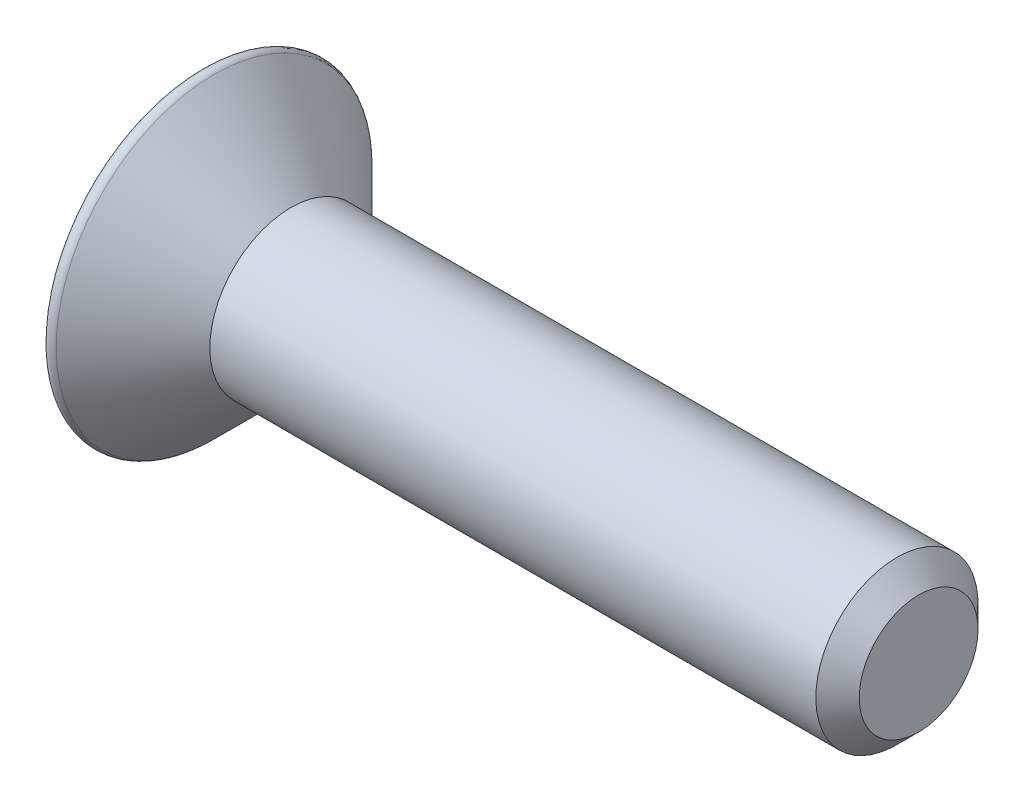
ISO-10303-21;
HEADER;
FILE_DESCRIPTION(('STEP AP214'),'2;1');
FILE_NAME('part.step','',(''),(''),'','','');
FILE_SCHEMA(('AUTOMOTIVE_DESIGN { 1 0 10303 214 1 1 1 1 }'));
ENDSEC;
DATA;
#1=APPLICATION_CONTEXT('core data for automotive mechanical design processes');
#2=APPLICATION_PROTOCOL_DEFINITION('international standard','automotive_design',2000,#1);
#3=PRODUCT_CONTEXT('',#1,'mechanical');
#4=PRODUCT('Part','Part','',(#3));
#5=PRODUCT_RELATED_PRODUCT_CATEGORY('part','',(#4));
#6=PRODUCT_DEFINITION_FORMATION('','',#4);
#7=PRODUCT_DEFINITION_CONTEXT('part definition',#1,'design');
#8=PRODUCT_DEFINITION('design','',#6,#7);
#9=PRODUCT_DEFINITION_SHAPE('','',#8);
#10=(LENGTH_UNIT() NAMED_UNIT(*) SI_UNIT(.MILLI.,.METRE.));
#11=(NAMED_UNIT(*) PLANE_ANGLE_UNIT() SI_UNIT($,.RADIAN.));
#12=(NAMED_UNIT(*) SI_UNIT($,.STERADIAN.) SOLID_ANGLE_UNIT());
#13=UNCERTAINTY_MEASURE_WITH_UNIT(LENGTH_MEASURE(1.E-05),#10,'distance_accuracy_value','');
#14=(GEOMETRIC_REPRESENTATION_CONTEXT(3) GLOBAL_UNCERTAINTY_ASSIGNED_CONTEXT((#13)) GLOBAL_UNIT_ASSIGNED_CONTEXT((#10,
#11,#12)) REPRESENTATION_CONTEXT('',''));
#15=CARTESIAN_POINT('',(0.,0.,0.));
#16=DIRECTION('',(0.,0.,1.));
#17=DIRECTION('',(1.,0.,0.));
#18=AXIS2_PLACEMENT_3D('',#15,#16,#17);
#19=CARTESIAN_POINT('',(0.,0.,0.));
#20=DIRECTION('',(1.,0.,0.));
#21=DIRECTION('',(0.,1.,0.));
#22=AXIS2_PLACEMENT_3D('',#19,#20,#21);
#23=PLANE('',#22);
#24=CARTESIAN_POINT('',(0.,0.,0.));
#25=DIRECTION('',(1.,0.,0.));
#26=DIRECTION('',(0.,1.,0.));
#27=AXIS2_PLACEMENT_3D('',#24,#25,#26);
#28=CIRCLE('',#27,1.0414);
#29=CARTESIAN_POINT('',(0.,1.0414,0.));
#30=VERTEX_POINT('',#29);
#31=EDGE_CURVE('E11',#30,#30,#28,.T.);
#32=ORIENTED_EDGE('',*,*,#31,.T.);
#33=EDGE_LOOP('',(#32));
#34=FACE_BOUND('',#33,.T.);
#35=ADVANCED_FACE('F40',(#34),#23,.T.);
#36=CARTESIAN_POINT('',(0.,0.,0.));
#37=DIRECTION('',(-1.,0.,0.));
#38=DIRECTION('',(0.,-1.,0.));
#39=AXIS2_PLACEMENT_3D('',#36,#37,#38);
#40=CONICAL_SURFACE('',#39,1.0414,0.785398163397449);
#41=CARTESIAN_POINT('',(-0.380999999999992,0.,0.));
#42=DIRECTION('',(1.,0.,0.));
#43=DIRECTION('',(0.,1.,0.));
#44=AXIS2_PLACEMENT_3D('',#41,#42,#43);
#45=CIRCLE('',#44,1.4224);
#46=CARTESIAN_POINT('',(-0.380999999999993,1.4224,0.));
#47=VERTEX_POINT('',#46);
#48=EDGE_CURVE('E48',#47,#47,#45,.T.);
#49=ORIENTED_EDGE('',*,*,#48,.T.);
#50=EDGE_LOOP('',(#49));
#51=FACE_BOUND('',#50,.T.);
#52=ORIENTED_EDGE('',*,*,#31,.F.);
#53=EDGE_LOOP('',(#52));
#54=FACE_BOUND('',#53,.T.);
#55=ADVANCED_FACE('F199',(#51,#54),#40,.T.);
#56=CARTESIAN_POINT('',(0.,0.,0.));
#57=DIRECTION('',(1.,0.,0.));
#58=DIRECTION('',(0.,1.,0.));
#59=AXIS2_PLACEMENT_3D('',#56,#57,#58);
#60=CYLINDRICAL_SURFACE('',#59,1.4224);
#61=CARTESIAN_POINT('',(-11.0090948775786,0.,0.));
#62=DIRECTION('',(1.,0.,0.));
#63=DIRECTION('',(0.,1.,0.));
#64=AXIS2_PLACEMENT_3D('',#61,#62,#63);
#65=CIRCLE('',#64,1.4224);
#66=CARTESIAN_POINT('',(-11.0090948775786,1.4224,0.));
#67=VERTEX_POINT('',#66);
#68=EDGE_CURVE('E193',#67,#67,#65,.T.);
#69=ORIENTED_EDGE('',*,*,#68,.T.);
#70=EDGE_LOOP('',(#69));
#71=FACE_BOUND('',#70,.T.);
#72=ORIENTED_EDGE('',*,*,#48,.F.);
#73=EDGE_LOOP('',(#72));
#74=FACE_BOUND('',#73,.T.);
#75=ADVANCED_FACE('F202',(#71,#74),#60,.T.);
#76=CARTESIAN_POINT('',(-11.0090948775786,0.,0.));
#77=DIRECTION('',(-1.,0.,0.));
#78=DIRECTION('',(0.,-1.,0.));
#79=AXIS2_PLACEMENT_3D('',#76,#77,#78);
#80=CONICAL_SURFACE('',#79,1.4224,0.785398163397454);
#81=CARTESIAN_POINT('',(-12.3561974387893,0.,0.));
#82=DIRECTION('',(1.,0.,0.));
#83=DIRECTION('',(0.,1.,0.));
#84=AXIS2_PLACEMENT_3D('',#81,#82,#83);
#85=CIRCLE('',#84,2.76950256121069);
#86=CARTESIAN_POINT('',(-12.3561974387893,2.76950256121069,0.));
#87=VERTEX_POINT('',#86);
#88=EDGE_CURVE('E190',#87,#87,#85,.T.);
#89=ORIENTED_EDGE('',*,*,#88,.T.);
#90=EDGE_LOOP('',(#89));
#91=FACE_BOUND('',#90,.T.);
#92=ORIENTED_EDGE('',*,*,#68,.F.);
#93=EDGE_LOOP('',(#92));
#94=FACE_BOUND('',#93,.T.);
#95=ADVANCED_FACE('F204',(#91,#94),#80,.T.);
#96=CARTESIAN_POINT('',(-12.446,0.,0.));
#97=DIRECTION('',(1.,0.,0.));
#98=DIRECTION('',(0.,1.,0.));
#99=AXIS2_PLACEMENT_3D('',#96,#97,#98);
#100=TOROIDAL_SURFACE('',#99,2.6797,0.127);
#101=CARTESIAN_POINT('',(-12.573,0.,0.));
#102=DIRECTION('',(1.,0.,0.));
#103=DIRECTION('',(0.,1.,0.));
#104=AXIS2_PLACEMENT_3D('',#101,#102,#103);
#105=CIRCLE('',#104,2.6797);
#106=CARTESIAN_POINT('',(-12.573,2.6797,0.));
#107=VERTEX_POINT('',#106);
#108=EDGE_CURVE('E187',#107,#107,#105,.T.);
#109=ORIENTED_EDGE('',*,*,#108,.T.);
#110=EDGE_LOOP('',(#109));
#111=FACE_BOUND('',#110,.T.);
#112=ORIENTED_EDGE('',*,*,#88,.F.);
#113=EDGE_LOOP('',(#112));
#114=FACE_BOUND('',#113,.T.);
#115=ADVANCED_FACE('F211',(#111,#114),#100,.T.);
#116=CARTESIAN_POINT('',(-12.573,0.,0.));
#117=DIRECTION('',(-1.,0.,0.));
#118=DIRECTION('',(0.,-1.,0.));
#119=AXIS2_PLACEMENT_3D('',#116,#117,#118);
#120=PLANE('',#119);
#121=DIRECTION('',(0.,0.,-1.));
#122=VECTOR('',#121,1.);
#123=CARTESIAN_POINT('',(-12.573,0.381,-0.380999999999999));
#124=LINE('',#123,#122);
#125=CARTESIAN_POINT('',(-12.573,0.381,-0.380999999999999));
#126=VERTEX_POINT('',#125);
#127=CARTESIAN_POINT('',(-12.573,0.380999999999987,-1.905));
#128=VERTEX_POINT('',#127);
#129=EDGE_CURVE('E55',#126,#128,#124,.T.);
#130=ORIENTED_EDGE('',*,*,#129,.F.);
#131=DIRECTION('',(0.,-0.999999999999999,0.));
#132=VECTOR('',#131,1.);
#133=CARTESIAN_POINT('',(-12.573,1.90499999999999,-0.380999999999999));
#134=LINE('',#133,#132);
#135=CARTESIAN_POINT('',(-12.573,1.90499999999999,-0.380999999999999));
#136=VERTEX_POINT('',#135);
#137=EDGE_CURVE('E156',#136,#126,#134,.T.);
#138=ORIENTED_EDGE('',*,*,#137,.F.);
#139=DIRECTION('',(0.,0.,-1.));
#140=VECTOR('',#139,1.);
#141=CARTESIAN_POINT('',(-12.573,1.905,0.380999999999997));
#142=LINE('',#141,#140);
#143=CARTESIAN_POINT('',(-12.573,1.905,0.380999999999997));
#144=VERTEX_POINT('',#143);
#145=EDGE_CURVE('E153',#144,#136,#142,.T.);
#146=ORIENTED_EDGE('',*,*,#145,.F.);
#147=DIRECTION('',(0.,0.999999999999999,0.));
#148=VECTOR('',#147,1.);
#149=CARTESIAN_POINT('',(-12.573,1.905,0.380999999999997));
#150=LINE('',#149,#148);
#151=CARTESIAN_POINT('',(-12.573,0.380999999999989,0.380999999999999));
#152=VERTEX_POINT('',#151);
#153=EDGE_CURVE('E150',#152,#144,#150,.T.);
#154=ORIENTED_EDGE('',*,*,#153,.F.);
#155=DIRECTION('',(0.,0.,-0.999999999999999));
#156=VECTOR('',#155,1.);
#157=CARTESIAN_POINT('',(-12.573,0.380999999999992,1.905));
#158=LINE('',#157,#156);
#159=CARTESIAN_POINT('',(-12.573,0.380999999999992,1.905));
#160=VERTEX_POINT('',#159);
#161=EDGE_CURVE('E147',#160,#152,#158,.T.);
#162=ORIENTED_EDGE('',*,*,#161,.F.);
#163=DIRECTION('',(0.,1.,0.));
#164=VECTOR('',#163,1.);
#165=CARTESIAN_POINT('',(-12.573,-0.380999999999998,1.905));
#166=LINE('',#165,#164);
#167=CARTESIAN_POINT('',(-12.573,-0.380999999999998,1.905));
#168=VERTEX_POINT('',#167);
#169=EDGE_CURVE('E144',#168,#160,#166,.T.);
#170=ORIENTED_EDGE('',*,*,#169,.F.);
#171=DIRECTION('',(0.,0.,1.));
#172=VECTOR('',#171,1.);
#173=CARTESIAN_POINT('',(-12.573,-0.380999999999998,1.905));
#174=LINE('',#173,#172);
#175=CARTESIAN_POINT('',(-12.573,-0.381000000000013,0.380999999999999));
#176=VERTEX_POINT('',#175);
#177=EDGE_CURVE('E141',#176,#168,#174,.T.);
#178=ORIENTED_EDGE('',*,*,#177,.F.);
#179=DIRECTION('',(0.,1.,0.));
#180=VECTOR('',#179,1.);
#181=CARTESIAN_POINT('',(-12.573,-0.381000000000013,0.380999999999999));
#182=LINE('',#181,#180);
#183=CARTESIAN_POINT('',(-12.573,-1.905,0.381));
#184=VERTEX_POINT('',#183);
#185=EDGE_CURVE('E138',#184,#176,#182,.T.);
#186=ORIENTED_EDGE('',*,*,#185,.F.);
#187=DIRECTION('',(0.,0.,1.));
#188=VECTOR('',#187,1.);
#189=CARTESIAN_POINT('',(-12.573,-1.905,0.381));
#190=LINE('',#189,#188);
#191=CARTESIAN_POINT('',(-12.573,-1.90500000000001,-0.380999999999999));
#192=VERTEX_POINT('',#191);
#193=EDGE_CURVE('E132',#192,#184,#190,.T.);
#194=ORIENTED_EDGE('',*,*,#193,.F.);
#195=DIRECTION('',(0.,-1.,0.));
#196=VECTOR('',#195,1.);
#197=CARTESIAN_POINT('',(-12.573,-0.381000000000008,-0.380999999999997));
#198=LINE('',#197,#196);
#199=CARTESIAN_POINT('',(-12.573,-0.381000000000008,-0.380999999999997));
#200=VERTEX_POINT('',#199);
#201=EDGE_CURVE('E130',#200,#192,#198,.T.);
#202=ORIENTED_EDGE('',*,*,#201,.F.);
#203=DIRECTION('',(0.,0.,1.));
#204=VECTOR('',#203,1.);
#205=CARTESIAN_POINT('',(-12.573,-0.381000000000008,-0.380999999999997));
#206=LINE('',#205,#204);
#207=CARTESIAN_POINT('',(-12.573,-0.381000000000003,-1.905));
#208=VERTEX_POINT('',#207);
#209=EDGE_CURVE('E114',#208,#200,#206,.T.);
#210=ORIENTED_EDGE('',*,*,#209,.F.);
#211=DIRECTION('',(0.,-1.,0.));
#212=VECTOR('',#211,1.);
#213=CARTESIAN_POINT('',(-12.573,-0.381000000000003,-1.905));
#214=LINE('',#213,#212);
#215=EDGE_CURVE('E122',#128,#208,#214,.T.);
#216=ORIENTED_EDGE('',*,*,#215,.F.);
#217=EDGE_LOOP('',(#130,#138,#146,#154,#162,#170,#178,#186,#194,#202,#210,#216));
#218=FACE_BOUND('',#217,.T.);
#219=ORIENTED_EDGE('',*,*,#108,.F.);
#220=EDGE_LOOP('',(#219));
#221=FACE_BOUND('',#220,.T.);
#222=ADVANCED_FACE('F126',(#218,#221),#120,.T.);
#223=CARTESIAN_POINT('',(-12.573,0.381,-0.380999999999999));
#224=DIRECTION('',(0.4226182617407,0.906307787036649,0.));
#225=DIRECTION('',(-0.906307787036649,0.4226182617407,0.));
#226=AXIS2_PLACEMENT_3D('',#223,#224,#225);
#227=PLANE('',#226);
#228=DIRECTION('',(0.,0.,1.));
#229=VECTOR('',#228,1.);
#230=CARTESIAN_POINT('',(-11.7559428632859,0.,-0.381));
#231=LINE('',#230,#229);
#232=CARTESIAN_POINT('',(-11.7559428632859,0.,-1.524));
#233=VERTEX_POINT('',#232);
#234=CARTESIAN_POINT('',(-11.7559428632859,0.,0.));
#235=VERTEX_POINT('',#234);
#236=EDGE_CURVE('E116',#233,#235,#231,.T.);
#237=ORIENTED_EDGE('',*,*,#236,.T.);
#238=DIRECTION('',(-0.834817129478987,0.389281620635026,-0.389281620635026));
#239=VECTOR('',#238,1.);
#240=CARTESIAN_POINT('',(-12.573,0.381,-0.380999999999999));
#241=LINE('',#240,#239);
#242=EDGE_CURVE('E159',#235,#126,#241,.T.);
#243=ORIENTED_EDGE('',*,*,#242,.T.);
#244=ORIENTED_EDGE('',*,*,#129,.T.);
#245=DIRECTION('',(-0.834817129478987,0.389281620635026,-0.389281620635026));
#246=VECTOR('',#245,1.);
#247=CARTESIAN_POINT('',(-12.0777320571915,0.150052765429703,-1.67405276542971));
#248=LINE('',#247,#246);
#249=EDGE_CURVE('E119',#233,#128,#248,.T.);
#250=ORIENTED_EDGE('',*,*,#249,.F.);
#251=EDGE_LOOP('',(#237,#243,#244,#250));
#252=FACE_BOUND('',#251,.T.);
#253=ADVANCED_FACE('F251',(#252),#227,.F.);
#254=CARTESIAN_POINT('',(-12.573,1.90499999999999,-0.380999999999999));
#255=DIRECTION('',(0.422618261740701,0.,-0.906307787036649));
#256=DIRECTION('',(-0.906307787036649,0.,-0.422618261740701));
#257=AXIS2_PLACEMENT_3D('',#254,#255,#256);
#258=PLANE('',#257);
#259=DIRECTION('',(-0.834817129478987,0.389281620635026,-0.389281620635026));
#260=VECTOR('',#259,1.);
#261=CARTESIAN_POINT('',(-12.3253660285957,1.78952638271485,-0.265526382714857));
#262=LINE('',#261,#260);
#263=CARTESIAN_POINT('',(-11.7559428632859,1.524,0.));
#264=VERTEX_POINT('',#263);
#265=EDGE_CURVE('E161',#264,#136,#262,.T.);
#266=ORIENTED_EDGE('',*,*,#265,.T.);
#267=ORIENTED_EDGE('',*,*,#137,.T.);
#268=ORIENTED_EDGE('',*,*,#242,.F.);
#269=DIRECTION('',(0.,-0.999999999999999,0.));
#270=VECTOR('',#269,1.);
#271=CARTESIAN_POINT('',(-11.7559428632859,1.90499999999999,0.));
#272=LINE('',#271,#270);
#273=EDGE_CURVE('E63',#264,#235,#272,.T.);
#274=ORIENTED_EDGE('',*,*,#273,.F.);
#275=EDGE_LOOP('',(#266,#267,#268,#274));
#276=FACE_BOUND('',#275,.T.);
#277=ADVANCED_FACE('F260',(#276),#258,.F.);
#278=CARTESIAN_POINT('',(-12.573,1.905,0.380999999999997));
#279=DIRECTION('',(0.4226182617407,0.906307787036649,0.));
#280=DIRECTION('',(-0.90630778703665,0.4226182617407,0.));
#281=AXIS2_PLACEMENT_3D('',#278,#279,#280);
#282=PLANE('',#281);
#283=ORIENTED_EDGE('',*,*,#145,.T.);
#284=ORIENTED_EDGE('',*,*,#265,.F.);
#285=DIRECTION('',(-0.834817129478987,0.389281620635026,0.389281620635026));
#286=VECTOR('',#285,1.);
#287=CARTESIAN_POINT('',(-12.573,1.905,0.380999999999997));
#288=LINE('',#287,#286);
#289=EDGE_CURVE('E176',#264,#144,#288,.T.);
#290=ORIENTED_EDGE('',*,*,#289,.T.);
#291=EDGE_LOOP('',(#283,#284,#290));
#292=FACE_BOUND('',#291,.T.);
#293=ADVANCED_FACE('F269',(#292),#282,.F.);
#294=CARTESIAN_POINT('',(-12.573,1.905,0.380999999999997));
#295=DIRECTION('',(0.422618261740701,0.,0.906307787036649));
#296=DIRECTION('',(0.906307787036649,0.,-0.4226182617407));
#297=AXIS2_PLACEMENT_3D('',#294,#295,#296);
#298=PLANE('',#297);
#299=ORIENTED_EDGE('',*,*,#273,.T.);
#300=DIRECTION('',(-0.834817129478987,0.389281620635026,0.389281620635026));
#301=VECTOR('',#300,1.);
#302=CARTESIAN_POINT('',(-13.0682679428085,0.61194723457028,0.61194723457029));
#303=LINE('',#302,#301);
#304=EDGE_CURVE('E174',#235,#152,#303,.T.);
#305=ORIENTED_EDGE('',*,*,#304,.T.);
#306=ORIENTED_EDGE('',*,*,#153,.T.);
#307=ORIENTED_EDGE('',*,*,#289,.F.);
#308=EDGE_LOOP('',(#299,#305,#306,#307));
#309=FACE_BOUND('',#308,.T.);
#310=ADVANCED_FACE('F279',(#309),#298,.F.);
#311=CARTESIAN_POINT('',(-12.573,0.380999999999992,1.905));
#312=DIRECTION('',(0.4226182617407,0.906307787036649,0.));
#313=DIRECTION('',(-0.906307787036649,0.4226182617407,0.));
#314=AXIS2_PLACEMENT_3D('',#311,#312,#313);
#315=PLANE('',#314);
#316=DIRECTION('',(-0.834817129478987,0.389281620635026,0.389281620635026));
#317=VECTOR('',#316,1.);
#318=CARTESIAN_POINT('',(-12.3253660285957,0.265526382714845,1.78952638271486));
#319=LINE('',#318,#317);
#320=CARTESIAN_POINT('',(-11.7559428632859,0.,1.524));
#321=VERTEX_POINT('',#320);
#322=EDGE_CURVE('E172',#321,#160,#319,.T.);
#323=ORIENTED_EDGE('',*,*,#322,.T.);
#324=ORIENTED_EDGE('',*,*,#161,.T.);
#325=ORIENTED_EDGE('',*,*,#304,.F.);
#326=DIRECTION('',(0.,0.,-1.));
#327=VECTOR('',#326,1.);
#328=CARTESIAN_POINT('',(-11.7559428632859,0.,1.905));
#329=LINE('',#328,#327);
#330=EDGE_CURVE('E180',#321,#235,#329,.T.);
#331=ORIENTED_EDGE('',*,*,#330,.F.);
#332=EDGE_LOOP('',(#323,#324,#325,#331));
#333=FACE_BOUND('',#332,.T.);
#334=ADVANCED_FACE('F289',(#333),#315,.F.);
#335=CARTESIAN_POINT('',(-12.573,-0.380999999999998,1.905));
#336=DIRECTION('',(0.422618261740701,0.,0.906307787036649));
#337=DIRECTION('',(0.906307787036649,0.,-0.4226182617407));
#338=AXIS2_PLACEMENT_3D('',#335,#336,#337);
#339=PLANE('',#338);
#340=ORIENTED_EDGE('',*,*,#169,.T.);
#341=ORIENTED_EDGE('',*,*,#322,.F.);
#342=DIRECTION('',(-0.834817129478987,-0.389281620635026,0.389281620635026));
#343=VECTOR('',#342,1.);
#344=CARTESIAN_POINT('',(-12.573,-0.380999999999998,1.905));
#345=LINE('',#344,#343);
#346=EDGE_CURVE('E170',#321,#168,#345,.T.);
#347=ORIENTED_EDGE('',*,*,#346,.T.);
#348=EDGE_LOOP('',(#340,#341,#347));
#349=FACE_BOUND('',#348,.T.);
#350=ADVANCED_FACE('F298',(#349),#339,.F.);
#351=CARTESIAN_POINT('',(-12.573,-0.380999999999998,1.905));
#352=DIRECTION('',(0.422618261740701,-0.906307787036649,0.));
#353=DIRECTION('',(0.906307787036649,0.4226182617407,0.));
#354=AXIS2_PLACEMENT_3D('',#351,#352,#353);
#355=PLANE('',#354);
#356=ORIENTED_EDGE('',*,*,#330,.T.);
#357=DIRECTION('',(-0.834817129478987,-0.389281620635026,0.389281620635026));
#358=VECTOR('',#357,1.);
#359=CARTESIAN_POINT('',(-13.0682679428085,-0.611947234570294,0.61194723457029));
#360=LINE('',#359,#358);
#361=EDGE_CURVE('E168',#235,#176,#360,.T.);
#362=ORIENTED_EDGE('',*,*,#361,.T.);
#363=ORIENTED_EDGE('',*,*,#177,.T.);
#364=ORIENTED_EDGE('',*,*,#346,.F.);
#365=EDGE_LOOP('',(#356,#362,#363,#364));
#366=FACE_BOUND('',#365,.T.);
#367=ADVANCED_FACE('F308',(#366),#355,.F.);
#368=CARTESIAN_POINT('',(-12.573,-0.381000000000013,0.380999999999999));
#369=DIRECTION('',(0.422618261740701,0.,0.906307787036649));
#370=DIRECTION('',(0.906307787036649,0.,-0.4226182617407));
#371=AXIS2_PLACEMENT_3D('',#368,#369,#370);
#372=PLANE('',#371);
#373=DIRECTION('',(-0.834817129478987,-0.389281620635026,0.389281620635026));
#374=VECTOR('',#373,1.);
#375=CARTESIAN_POINT('',(-12.573,-1.905,0.381));
#376=LINE('',#375,#374);
#377=CARTESIAN_POINT('',(-11.7559428632859,-1.52400000000001,0.));
#378=VERTEX_POINT('',#377);
#379=EDGE_CURVE('E166',#378,#184,#376,.T.);
#380=ORIENTED_EDGE('',*,*,#379,.T.);
#381=ORIENTED_EDGE('',*,*,#185,.T.);
#382=ORIENTED_EDGE('',*,*,#361,.F.);
#383=DIRECTION('',(0.,1.,0.));
#384=VECTOR('',#383,1.);
#385=CARTESIAN_POINT('',(-11.7559428632859,-0.381000000000006,0.));
#386=LINE('',#385,#384);
#387=EDGE_CURVE('E183',#378,#235,#386,.T.);
#388=ORIENTED_EDGE('',*,*,#387,.F.);
#389=EDGE_LOOP('',(#380,#381,#382,#388));
#390=FACE_BOUND('',#389,.T.);
#391=ADVANCED_FACE('F318',(#390),#372,.F.);
#392=CARTESIAN_POINT('',(-12.573,-1.905,0.381));
#393=DIRECTION('',(0.422618261740701,-0.906307787036649,0.));
#394=DIRECTION('',(0.906307787036649,0.4226182617407,0.));
#395=AXIS2_PLACEMENT_3D('',#392,#393,#394);
#396=PLANE('',#395);
#397=ORIENTED_EDGE('',*,*,#193,.T.);
#398=ORIENTED_EDGE('',*,*,#379,.F.);
#399=DIRECTION('',(-0.834817129478987,-0.389281620635026,-0.389281620635026));
#400=VECTOR('',#399,1.);
#401=CARTESIAN_POINT('',(-12.0777320571915,-1.67405276542972,-0.150052765429711));
#402=LINE('',#401,#400);
#403=EDGE_CURVE('E164',#378,#192,#402,.T.);
#404=ORIENTED_EDGE('',*,*,#403,.T.);
#405=EDGE_LOOP('',(#397,#398,#404));
#406=FACE_BOUND('',#405,.T.);
#407=ADVANCED_FACE('F328',(#406),#396,.F.);
#408=CARTESIAN_POINT('',(-12.573,-0.381000000000008,-0.380999999999997));
#409=DIRECTION('',(0.422618261740701,0.,-0.906307787036649));
#410=DIRECTION('',(-0.906307787036649,0.,-0.422618261740701));
#411=AXIS2_PLACEMENT_3D('',#408,#409,#410);
#412=PLANE('',#411);
#413=ORIENTED_EDGE('',*,*,#387,.T.);
#414=DIRECTION('',(-0.834817129478987,-0.389281620635026,-0.389281620635026));
#415=VECTOR('',#414,1.);
#416=CARTESIAN_POINT('',(-12.573,-0.381000000000008,-0.380999999999997));
#417=LINE('',#416,#415);
#418=EDGE_CURVE('E118',#235,#200,#417,.T.);
#419=ORIENTED_EDGE('',*,*,#418,.T.);
#420=ORIENTED_EDGE('',*,*,#201,.T.);
#421=ORIENTED_EDGE('',*,*,#403,.F.);
#422=EDGE_LOOP('',(#413,#419,#420,#421));
#423=FACE_BOUND('',#422,.T.);
#424=ADVANCED_FACE('F338',(#423),#412,.F.);
#425=CARTESIAN_POINT('',(-12.573,-0.381000000000008,-0.380999999999997));
#426=DIRECTION('',(0.422618261740701,-0.906307787036649,0.));
#427=DIRECTION('',(0.906307787036649,0.4226182617407,0.));
#428=AXIS2_PLACEMENT_3D('',#425,#426,#427);
#429=PLANE('',#428);
#430=DIRECTION('',(-0.834817129478987,-0.389281620635026,-0.389281620635026));
#431=VECTOR('',#430,1.);
#432=CARTESIAN_POINT('',(-12.573,-0.381000000000003,-1.905));
#433=LINE('',#432,#431);
#434=EDGE_CURVE('E109',#233,#208,#433,.T.);
#435=ORIENTED_EDGE('',*,*,#434,.T.);
#436=ORIENTED_EDGE('',*,*,#209,.T.);
#437=ORIENTED_EDGE('',*,*,#418,.F.);
#438=ORIENTED_EDGE('',*,*,#236,.F.);
#439=EDGE_LOOP('',(#435,#436,#437,#438));
#440=FACE_BOUND('',#439,.T.);
#441=ADVANCED_FACE('F111',(#440),#429,.F.);
#442=CARTESIAN_POINT('',(-12.573,-0.381000000000003,-1.905));
#443=DIRECTION('',(0.422618261740701,0.,-0.906307787036649));
#444=DIRECTION('',(-0.906307787036649,0.,-0.422618261740701));
#445=AXIS2_PLACEMENT_3D('',#442,#443,#444);
#446=PLANE('',#445);
#447=ORIENTED_EDGE('',*,*,#215,.T.);
#448=ORIENTED_EDGE('',*,*,#434,.F.);
#449=ORIENTED_EDGE('',*,*,#249,.T.);
#450=EDGE_LOOP('',(#447,#448,#449));
#451=FACE_BOUND('',#450,.T.);
#452=ADVANCED_FACE('F123',(#451),#446,.F.);
#453=CLOSED_SHELL('',(#35,#55,#75,#95,#115,#222,#253,#277,#293,#310,#334,#350,#367,#391,#407,
#424,#441,#452));
#454=MANIFOLD_SOLID_BREP('B2',#453);
#455=ADVANCED_BREP_SHAPE_REPRESENTATION('',(#18,#454),#14);
#456=SHAPE_DEFINITION_REPRESENTATION(#9,#455);
ENDSEC;
END-ISO-10303-21;
